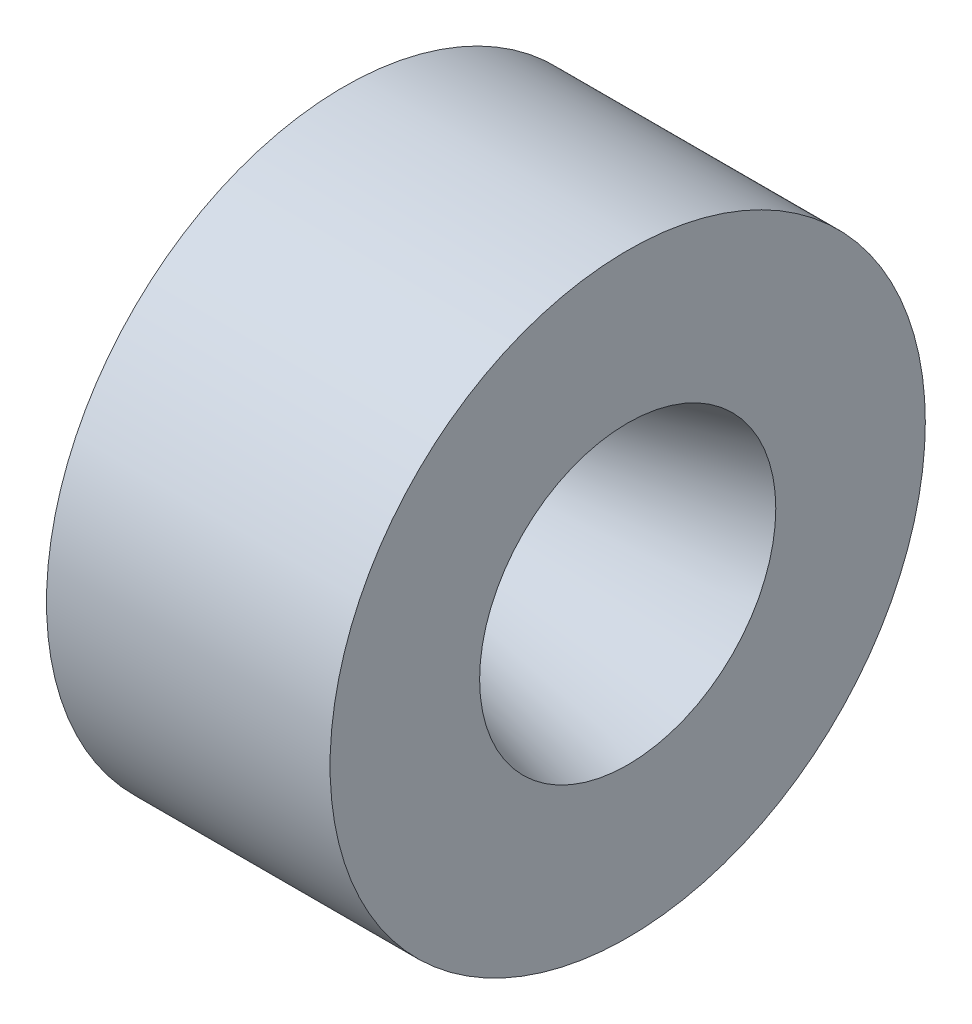
ISO-10303-21;
HEADER;
FILE_DESCRIPTION(('STEP AP214'),'2;1');
FILE_NAME('part.step','',(''),(''),'','','');
FILE_SCHEMA(('AUTOMOTIVE_DESIGN { 1 0 10303 214 1 1 1 1 }'));
ENDSEC;
DATA;
#1=APPLICATION_CONTEXT('core data for automotive mechanical design processes');
#2=APPLICATION_PROTOCOL_DEFINITION('international standard','automotive_design',2000,#1);
#3=PRODUCT_CONTEXT('',#1,'mechanical');
#4=PRODUCT('Part','Part','',(#3));
#5=PRODUCT_RELATED_PRODUCT_CATEGORY('part','',(#4));
#6=PRODUCT_DEFINITION_FORMATION('','',#4);
#7=PRODUCT_DEFINITION_CONTEXT('part definition',#1,'design');
#8=PRODUCT_DEFINITION('design','',#6,#7);
#9=PRODUCT_DEFINITION_SHAPE('','',#8);
#10=(LENGTH_UNIT() NAMED_UNIT(*) SI_UNIT(.MILLI.,.METRE.));
#11=(NAMED_UNIT(*) PLANE_ANGLE_UNIT() SI_UNIT($,.RADIAN.));
#12=(NAMED_UNIT(*) SI_UNIT($,.STERADIAN.) SOLID_ANGLE_UNIT());
#13=UNCERTAINTY_MEASURE_WITH_UNIT(LENGTH_MEASURE(1.E-05),#10,'distance_accuracy_value','');
#14=(GEOMETRIC_REPRESENTATION_CONTEXT(3) GLOBAL_UNCERTAINTY_ASSIGNED_CONTEXT((#13)) GLOBAL_UNIT_ASSIGNED_CONTEXT((#10,
#11,#12)) REPRESENTATION_CONTEXT('',''));
#15=CARTESIAN_POINT('',(0.,0.,0.));
#16=DIRECTION('',(0.,0.,1.));
#17=DIRECTION('',(1.,0.,0.));
#18=AXIS2_PLACEMENT_3D('',#15,#16,#17);
#19=CARTESIAN_POINT('',(152.7302,0.,0.));
#20=DIRECTION('',(1.,0.,0.));
#21=DIRECTION('',(0.,0.,-1.));
#22=AXIS2_PLACEMENT_3D('',#19,#20,#21);
#23=CYLINDRICAL_SURFACE('',#22,52.07);
#24=CARTESIAN_POINT('',(154.3304,0.,0.));
#25=DIRECTION('',(1.,0.,0.));
#26=DIRECTION('',(0.,0.,-1.));
#27=AXIS2_PLACEMENT_3D('',#24,#25,#26);
#28=CIRCLE('',#27,52.07);
#29=CARTESIAN_POINT('',(154.3304,0.,-52.07));
#30=VERTEX_POINT('',#29);
#31=EDGE_CURVE('E65',#30,#30,#28,.T.);
#32=ORIENTED_EDGE('',*,*,#31,.T.);
#33=EDGE_LOOP('',(#32));
#34=FACE_BOUND('',#33,.T.);
#35=CARTESIAN_POINT('',(203.941740446062,0.,0.));
#36=DIRECTION('',(1.,0.,0.));
#37=DIRECTION('',(0.,0.,-1.));
#38=AXIS2_PLACEMENT_3D('',#35,#36,#37);
#39=CIRCLE('',#38,52.07);
#40=CARTESIAN_POINT('',(203.941740446062,0.,-52.07));
#41=VERTEX_POINT('',#40);
#42=EDGE_CURVE('E77',#41,#41,#39,.T.);
#43=ORIENTED_EDGE('',*,*,#42,.F.);
#44=EDGE_LOOP('',(#43));
#45=FACE_BOUND('',#44,.T.);
#46=ADVANCED_FACE('F39',(#34,#45),#23,.T.);
#47=CARTESIAN_POINT('',(154.3304,52.07,0.));
#48=DIRECTION('',(-1.,0.,0.));
#49=DIRECTION('',(0.,0.,1.));
#50=AXIS2_PLACEMENT_3D('',#47,#48,#49);
#51=PLANE('',#50);
#52=CARTESIAN_POINT('',(154.3304,0.,0.));
#53=DIRECTION('',(-1.,0.,0.));
#54=DIRECTION('',(0.,0.,1.));
#55=AXIS2_PLACEMENT_3D('',#52,#53,#54);
#56=CIRCLE('',#55,44.069);
#57=CARTESIAN_POINT('',(154.3304,0.,44.069));
#58=VERTEX_POINT('',#57);
#59=EDGE_CURVE('E62',#58,#58,#56,.F.);
#60=ORIENTED_EDGE('',*,*,#59,.T.);
#61=EDGE_LOOP('',(#60));
#62=FACE_BOUND('',#61,.T.);
#63=ORIENTED_EDGE('',*,*,#31,.F.);
#64=EDGE_LOOP('',(#63));
#65=FACE_BOUND('',#64,.T.);
#66=ADVANCED_FACE('F85',(#62,#65),#51,.T.);
#67=CARTESIAN_POINT('',(152.7302,0.,0.));
#68=DIRECTION('',(1.,0.,0.));
#69=DIRECTION('',(0.,0.,-1.));
#70=AXIS2_PLACEMENT_3D('',#67,#68,#69);
#71=CYLINDRICAL_SURFACE('',#70,43.815);
#72=CARTESIAN_POINT('',(154.0764,0.,0.));
#73=DIRECTION('',(-1.,0.,0.));
#74=DIRECTION('',(0.,0.,1.));
#75=AXIS2_PLACEMENT_3D('',#72,#73,#74);
#76=CIRCLE('',#75,43.815);
#77=CARTESIAN_POINT('',(154.0764,0.,43.815));
#78=VERTEX_POINT('',#77);
#79=EDGE_CURVE('E59',#78,#78,#76,.T.);
#80=ORIENTED_EDGE('',*,*,#79,.T.);
#81=EDGE_LOOP('',(#80));
#82=FACE_BOUND('',#81,.T.);
#83=CARTESIAN_POINT('',(151.7904,0.,0.));
#84=DIRECTION('',(1.,0.,0.));
#85=DIRECTION('',(0.,0.,-1.));
#86=AXIS2_PLACEMENT_3D('',#83,#84,#85);
#87=CIRCLE('',#86,43.815);
#88=CARTESIAN_POINT('',(151.7904,0.,-43.815));
#89=VERTEX_POINT('',#88);
#90=EDGE_CURVE('E68',#89,#89,#87,.T.);
#91=ORIENTED_EDGE('',*,*,#90,.T.);
#92=EDGE_LOOP('',(#91));
#93=FACE_BOUND('',#92,.T.);
#94=ADVANCED_FACE('F91',(#82,#93),#71,.T.);
#95=CARTESIAN_POINT('',(151.7904,43.815,0.));
#96=DIRECTION('',(-1.,0.,0.));
#97=DIRECTION('',(0.,0.,1.));
#98=AXIS2_PLACEMENT_3D('',#95,#96,#97);
#99=PLANE('',#98);
#100=CARTESIAN_POINT('',(151.7904,0.,0.));
#101=DIRECTION('',(1.,0.,0.));
#102=DIRECTION('',(0.,0.,-1.));
#103=AXIS2_PLACEMENT_3D('',#100,#101,#102);
#104=CIRCLE('',#103,40.005);
#105=CARTESIAN_POINT('',(151.7904,0.,-40.005));
#106=VERTEX_POINT('',#105);
#107=EDGE_CURVE('E71',#106,#106,#104,.T.);
#108=ORIENTED_EDGE('',*,*,#107,.T.);
#109=EDGE_LOOP('',(#108));
#110=FACE_BOUND('',#109,.T.);
#111=ORIENTED_EDGE('',*,*,#90,.F.);
#112=EDGE_LOOP('',(#111));
#113=FACE_BOUND('',#112,.T.);
#114=ADVANCED_FACE('F121',(#110,#113),#99,.T.);
#115=CARTESIAN_POINT('',(152.7302,0.,0.));
#116=DIRECTION('',(1.,0.,0.));
#117=DIRECTION('',(0.,0.,-1.));
#118=AXIS2_PLACEMENT_3D('',#115,#116,#117);
#119=CYLINDRICAL_SURFACE('',#118,40.005);
#120=CARTESIAN_POINT('',(153.008159691599,0.,0.));
#121=DIRECTION('',(1.,0.,0.));
#122=DIRECTION('',(0.,0.,-1.));
#123=AXIS2_PLACEMENT_3D('',#120,#121,#122);
#124=CIRCLE('',#123,40.005);
#125=CARTESIAN_POINT('',(153.008159691599,0.,-40.005));
#126=VERTEX_POINT('',#125);
#127=EDGE_CURVE('E46',#126,#126,#124,.T.);
#128=ORIENTED_EDGE('',*,*,#127,.T.);
#129=EDGE_LOOP('',(#128));
#130=FACE_BOUND('',#129,.T.);
#131=ORIENTED_EDGE('',*,*,#107,.F.);
#132=EDGE_LOOP('',(#131));
#133=FACE_BOUND('',#132,.T.);
#134=ADVANCED_FACE('F113',(#130,#133),#119,.F.);
#135=CARTESIAN_POINT('',(154.3304,0.,0.));
#136=DIRECTION('',(-1.,0.,0.));
#137=DIRECTION('',(0.,0.,1.));
#138=AXIS2_PLACEMENT_3D('',#135,#136,#137);
#139=CONICAL_SURFACE('',#138,40.005,0.959931088596883);
#140=CARTESIAN_POINT('',(155.088805884093,0.,0.));
#141=DIRECTION('',(-1.,0.,0.));
#142=DIRECTION('',(0.,0.,1.));
#143=AXIS2_PLACEMENT_3D('',#140,#141,#142);
#144=CIRCLE('',#143,38.9218841483317);
#145=CARTESIAN_POINT('',(155.088805884093,0.,38.9218841483317));
#146=VERTEX_POINT('',#145);
#147=EDGE_CURVE('E10',#146,#146,#144,.T.);
#148=ORIENTED_EDGE('',*,*,#147,.T.);
#149=EDGE_LOOP('',(#148));
#150=FACE_BOUND('',#149,.T.);
#151=CARTESIAN_POINT('',(169.969365863758,0.,0.));
#152=DIRECTION('',(1.,0.,0.));
#153=DIRECTION('',(0.,0.,-1.));
#154=AXIS2_PLACEMENT_3D('',#151,#152,#153);
#155=CIRCLE('',#154,17.6702420741658);
#156=CARTESIAN_POINT('',(169.969365863758,0.,-17.6702420741658));
#157=VERTEX_POINT('',#156);
#158=EDGE_CURVE('E54',#157,#157,#155,.T.);
#159=ORIENTED_EDGE('',*,*,#158,.T.);
#160=EDGE_LOOP('',(#159));
#161=FACE_BOUND('',#160,.T.);
#162=ADVANCED_FACE('F110',(#150,#161),#139,.F.);
#163=CARTESIAN_POINT('',(170.479426495238,0.,0.));
#164=DIRECTION('',(1.,0.,0.));
#165=DIRECTION('',(0.,0.,-1.));
#166=AXIS2_PLACEMENT_3D('',#163,#164,#165);
#167=CONICAL_SURFACE('',#166,16.9418,0.26179938779915);
#168=CARTESIAN_POINT('',(171.338389147285,0.,0.));
#169=DIRECTION('',(-1.,0.,0.));
#170=DIRECTION('',(0.,0.,1.));
#171=AXIS2_PLACEMENT_3D('',#168,#169,#170);
#172=CIRCLE('',#171,17.1719583489445);
#173=CARTESIAN_POINT('',(171.338389147285,0.,17.1719583489445));
#174=VERTEX_POINT('',#173);
#175=EDGE_CURVE('E50',#174,#174,#172,.T.);
#176=ORIENTED_EDGE('',*,*,#175,.T.);
#177=EDGE_LOOP('',(#176));
#178=FACE_BOUND('',#177,.T.);
#179=CARTESIAN_POINT('',(203.941740446062,0.,0.));
#180=DIRECTION('',(1.,0.,0.));
#181=DIRECTION('',(0.,0.,-1.));
#182=AXIS2_PLACEMENT_3D('',#179,#180,#181);
#183=CIRCLE('',#182,25.908);
#184=CARTESIAN_POINT('',(203.941740446062,0.,-25.908));
#185=VERTEX_POINT('',#184);
#186=EDGE_CURVE('E74',#185,#185,#183,.T.);
#187=ORIENTED_EDGE('',*,*,#186,.T.);
#188=EDGE_LOOP('',(#187));
#189=FACE_BOUND('',#188,.T.);
#190=ADVANCED_FACE('F112',(#178,#189),#167,.F.);
#191=CARTESIAN_POINT('',(203.941740446062,25.908,0.));
#192=DIRECTION('',(1.,0.,0.));
#193=DIRECTION('',(0.,0.,-1.));
#194=AXIS2_PLACEMENT_3D('',#191,#192,#193);
#195=PLANE('',#194);
#196=ORIENTED_EDGE('',*,*,#42,.T.);
#197=EDGE_LOOP('',(#196));
#198=FACE_BOUND('',#197,.T.);
#199=ORIENTED_EDGE('',*,*,#186,.F.);
#200=EDGE_LOOP('',(#199));
#201=FACE_BOUND('',#200,.T.);
#202=ADVANCED_FACE('F81',(#198,#201),#195,.T.);
#203=CARTESIAN_POINT('',(154.0764,0.,0.));
#204=DIRECTION('',(-1.,0.,0.));
#205=DIRECTION('',(0.,0.,1.));
#206=AXIS2_PLACEMENT_3D('',#203,#204,#205);
#207=TOROIDAL_SURFACE('',#206,44.069,0.254);
#208=ORIENTED_EDGE('',*,*,#79,.F.);
#209=EDGE_LOOP('',(#208));
#210=FACE_BOUND('',#209,.T.);
#211=ORIENTED_EDGE('',*,*,#59,.F.);
#212=EDGE_LOOP('',(#211));
#213=FACE_BOUND('',#212,.T.);
#214=ADVANCED_FACE('F96',(#210,#213),#207,.F.);
#215=CARTESIAN_POINT('',(171.009688960005,0.,0.));
#216=DIRECTION('',(-1.,0.,0.));
#217=DIRECTION('',(0.,0.,1.));
#218=AXIS2_PLACEMENT_3D('',#215,#216,#217);
#219=TOROIDAL_SURFACE('',#218,18.3986841483317,1.27);
#220=ORIENTED_EDGE('',*,*,#175,.F.);
#221=EDGE_LOOP('',(#220));
#222=FACE_BOUND('',#221,.T.);
#223=ORIENTED_EDGE('',*,*,#158,.F.);
#224=EDGE_LOOP('',(#223));
#225=FACE_BOUND('',#224,.T.);
#226=ADVANCED_FACE('F98',(#222,#225),#219,.T.);
#227=CARTESIAN_POINT('',(153.008159691599,0.,0.));
#228=DIRECTION('',(1.,0.,0.));
#229=DIRECTION('',(0.,0.,-1.));
#230=AXIS2_PLACEMENT_3D('',#227,#228,#229);
#231=TOROIDAL_SURFACE('',#230,37.465,2.54);
#232=ORIENTED_EDGE('',*,*,#147,.F.);
#233=EDGE_LOOP('',(#232));
#234=FACE_BOUND('',#233,.T.);
#235=ORIENTED_EDGE('',*,*,#127,.F.);
#236=EDGE_LOOP('',(#235));
#237=FACE_BOUND('',#236,.T.);
#238=ADVANCED_FACE('F41',(#234,#237),#231,.F.);
#239=CLOSED_SHELL('',(#46,#66,#94,#114,#134,#162,#190,#202,#214,#226,#238));
#240=MANIFOLD_SOLID_BREP('B2',#239);
#241=ADVANCED_BREP_SHAPE_REPRESENTATION('',(#18,#240),#14);
#242=SHAPE_DEFINITION_REPRESENTATION(#9,#241);
ENDSEC;
END-ISO-10303-21;
